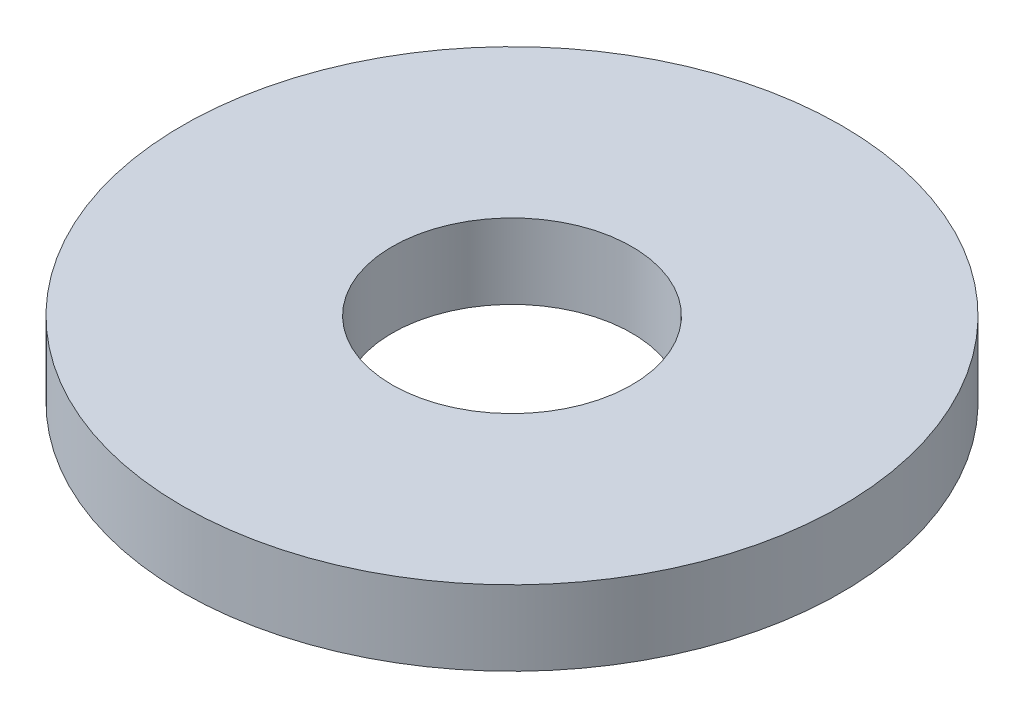
ISO-10303-21;
HEADER;
FILE_DESCRIPTION(('STEP AP214'),'2;1');
FILE_NAME('part.step','',(''),(''),'','','');
FILE_SCHEMA(('AUTOMOTIVE_DESIGN { 1 0 10303 214 1 1 1 1 }'));
ENDSEC;
DATA;
#1=APPLICATION_CONTEXT('core data for automotive mechanical design processes');
#2=APPLICATION_PROTOCOL_DEFINITION('international standard','automotive_design',2000,#1);
#3=PRODUCT_CONTEXT('',#1,'mechanical');
#4=PRODUCT('Part','Part','',(#3));
#5=PRODUCT_RELATED_PRODUCT_CATEGORY('part','',(#4));
#6=PRODUCT_DEFINITION_FORMATION('','',#4);
#7=PRODUCT_DEFINITION_CONTEXT('part definition',#1,'design');
#8=PRODUCT_DEFINITION('design','',#6,#7);
#9=PRODUCT_DEFINITION_SHAPE('','',#8);
#10=(LENGTH_UNIT() NAMED_UNIT(*) SI_UNIT(.MILLI.,.METRE.));
#11=(NAMED_UNIT(*) PLANE_ANGLE_UNIT() SI_UNIT($,.RADIAN.));
#12=(NAMED_UNIT(*) SI_UNIT($,.STERADIAN.) SOLID_ANGLE_UNIT());
#13=UNCERTAINTY_MEASURE_WITH_UNIT(LENGTH_MEASURE(1.E-05),#10,'distance_accuracy_value','');
#14=(GEOMETRIC_REPRESENTATION_CONTEXT(3) GLOBAL_UNCERTAINTY_ASSIGNED_CONTEXT((#13)) GLOBAL_UNIT_ASSIGNED_CONTEXT((#10,
#11,#12)) REPRESENTATION_CONTEXT('',''));
#15=CARTESIAN_POINT('',(0.,0.,0.));
#16=DIRECTION('',(0.,0.,1.));
#17=DIRECTION('',(1.,0.,0.));
#18=AXIS2_PLACEMENT_3D('',#15,#16,#17);
#19=CARTESIAN_POINT('',(0.,1.984375,0.));
#20=DIRECTION('',(0.,1.,0.));
#21=DIRECTION('',(0.,0.,1.));
#22=AXIS2_PLACEMENT_3D('',#19,#20,#21);
#23=PLANE('',#22);
#24=CARTESIAN_POINT('',(0.,1.984375,0.));
#25=DIRECTION('',(0.,1.,0.));
#26=DIRECTION('',(0.,0.,1.));
#27=AXIS2_PLACEMENT_3D('',#24,#25,#26);
#28=CIRCLE('',#27,8.73125);
#29=CARTESIAN_POINT('',(0.,1.984375,8.73125));
#30=VERTEX_POINT('',#29);
#31=EDGE_CURVE('E10',#30,#30,#28,.T.);
#32=ORIENTED_EDGE('',*,*,#31,.T.);
#33=EDGE_LOOP('',(#32));
#34=FACE_BOUND('',#33,.T.);
#35=CARTESIAN_POINT('',(0.,1.984375,0.));
#36=DIRECTION('',(0.,1.,0.));
#37=DIRECTION('',(0.,0.,1.));
#38=AXIS2_PLACEMENT_3D('',#35,#36,#37);
#39=CIRCLE('',#38,3.175);
#40=CARTESIAN_POINT('',(0.,1.984375,3.175));
#41=VERTEX_POINT('',#40);
#42=EDGE_CURVE('E45',#41,#41,#39,.T.);
#43=ORIENTED_EDGE('',*,*,#42,.F.);
#44=EDGE_LOOP('',(#43));
#45=FACE_BOUND('',#44,.T.);
#46=ADVANCED_FACE('F34',(#34,#45),#23,.T.);
#47=CARTESIAN_POINT('',(0.,0.,0.));
#48=DIRECTION('',(0.,1.,0.));
#49=DIRECTION('',(0.,0.,1.));
#50=AXIS2_PLACEMENT_3D('',#47,#48,#49);
#51=PLANE('',#50);
#52=CARTESIAN_POINT('',(0.,0.,0.));
#53=DIRECTION('',(0.,1.,0.));
#54=DIRECTION('',(0.,0.,1.));
#55=AXIS2_PLACEMENT_3D('',#52,#53,#54);
#56=CIRCLE('',#55,8.73125);
#57=CARTESIAN_POINT('',(0.,0.,8.73125));
#58=VERTEX_POINT('',#57);
#59=EDGE_CURVE('E38',#58,#58,#56,.T.);
#60=ORIENTED_EDGE('',*,*,#59,.F.);
#61=EDGE_LOOP('',(#60));
#62=FACE_BOUND('',#61,.T.);
#63=CARTESIAN_POINT('',(0.,0.,0.));
#64=DIRECTION('',(0.,1.,0.));
#65=DIRECTION('',(0.,0.,1.));
#66=AXIS2_PLACEMENT_3D('',#63,#64,#65);
#67=CIRCLE('',#66,3.175);
#68=CARTESIAN_POINT('',(0.,0.,3.175));
#69=VERTEX_POINT('',#68);
#70=EDGE_CURVE('E47',#69,#69,#67,.T.);
#71=ORIENTED_EDGE('',*,*,#70,.T.);
#72=EDGE_LOOP('',(#71));
#73=FACE_BOUND('',#72,.T.);
#74=ADVANCED_FACE('F57',(#62,#73),#51,.F.);
#75=CARTESIAN_POINT('',(0.,1.984375,0.));
#76=DIRECTION('',(0.,-1.,0.));
#77=DIRECTION('',(0.,0.,-1.));
#78=AXIS2_PLACEMENT_3D('',#75,#76,#77);
#79=CYLINDRICAL_SURFACE('',#78,8.73125);
#80=ORIENTED_EDGE('',*,*,#31,.F.);
#81=EDGE_LOOP('',(#80));
#82=FACE_BOUND('',#81,.T.);
#83=ORIENTED_EDGE('',*,*,#59,.T.);
#84=EDGE_LOOP('',(#83));
#85=FACE_BOUND('',#84,.T.);
#86=ADVANCED_FACE('F36',(#82,#85),#79,.T.);
#87=CARTESIAN_POINT('',(0.,1.984375,0.));
#88=DIRECTION('',(0.,-1.,0.));
#89=DIRECTION('',(0.,0.,-1.));
#90=AXIS2_PLACEMENT_3D('',#87,#88,#89);
#91=CYLINDRICAL_SURFACE('',#90,3.175);
#92=ORIENTED_EDGE('',*,*,#42,.T.);
#93=EDGE_LOOP('',(#92));
#94=FACE_BOUND('',#93,.T.);
#95=ORIENTED_EDGE('',*,*,#70,.F.);
#96=EDGE_LOOP('',(#95));
#97=FACE_BOUND('',#96,.T.);
#98=ADVANCED_FACE('F53',(#94,#97),#91,.F.);
#99=CLOSED_SHELL('',(#46,#74,#86,#98));
#100=MANIFOLD_SOLID_BREP('B2',#99);
#101=ADVANCED_BREP_SHAPE_REPRESENTATION('',(#18,#100),#14);
#102=SHAPE_DEFINITION_REPRESENTATION(#9,#101);
ENDSEC;
END-ISO-10303-21;
